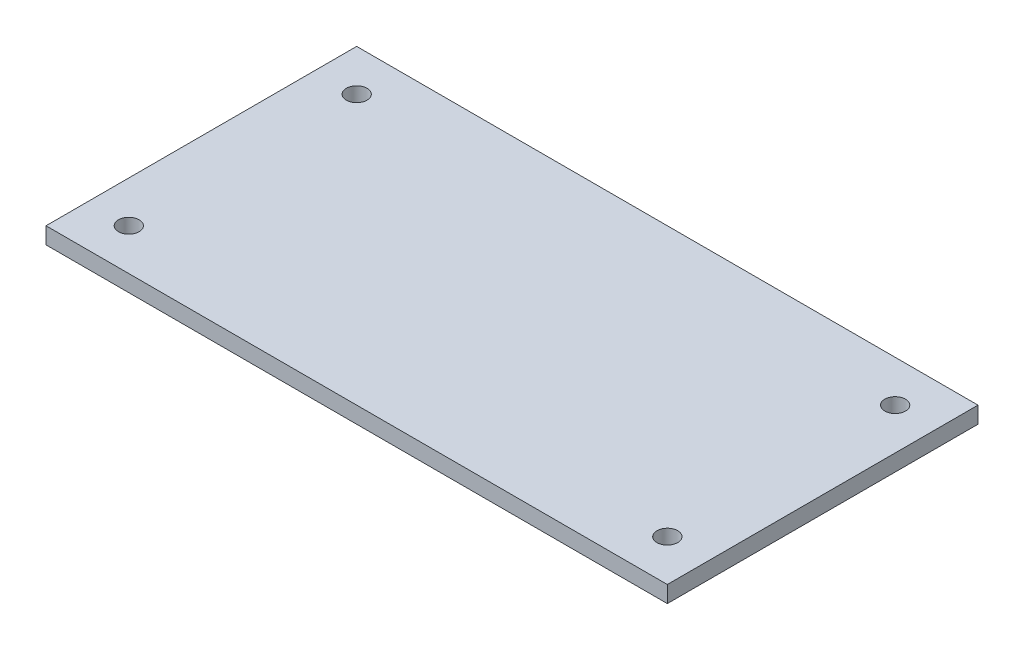
ISO-10303-21;
HEADER;
FILE_DESCRIPTION(('STEP AP214'),'2;1');
FILE_NAME('part.step','',(''),(''),'','','');
FILE_SCHEMA(('AUTOMOTIVE_DESIGN { 1 0 10303 214 1 1 1 1 }'));
ENDSEC;
DATA;
#1=APPLICATION_CONTEXT('core data for automotive mechanical design processes');
#2=APPLICATION_PROTOCOL_DEFINITION('international standard','automotive_design',2000,#1);
#3=PRODUCT_CONTEXT('',#1,'mechanical');
#4=PRODUCT('Part','Part','',(#3));
#5=PRODUCT_RELATED_PRODUCT_CATEGORY('part','',(#4));
#6=PRODUCT_DEFINITION_FORMATION('','',#4);
#7=PRODUCT_DEFINITION_CONTEXT('part definition',#1,'design');
#8=PRODUCT_DEFINITION('design','',#6,#7);
#9=PRODUCT_DEFINITION_SHAPE('','',#8);
#10=(LENGTH_UNIT() NAMED_UNIT(*) SI_UNIT(.MILLI.,.METRE.));
#11=(NAMED_UNIT(*) PLANE_ANGLE_UNIT() SI_UNIT($,.RADIAN.));
#12=(NAMED_UNIT(*) SI_UNIT($,.STERADIAN.) SOLID_ANGLE_UNIT());
#13=UNCERTAINTY_MEASURE_WITH_UNIT(LENGTH_MEASURE(1.E-05),#10,'distance_accuracy_value','');
#14=(GEOMETRIC_REPRESENTATION_CONTEXT(3) GLOBAL_UNCERTAINTY_ASSIGNED_CONTEXT((#13)) GLOBAL_UNIT_ASSIGNED_CONTEXT((#10,
#11,#12)) REPRESENTATION_CONTEXT('',''));
#15=CARTESIAN_POINT('',(0.,0.,0.));
#16=DIRECTION('',(0.,0.,1.));
#17=DIRECTION('',(1.,0.,0.));
#18=AXIS2_PLACEMENT_3D('',#15,#16,#17);
#19=CARTESIAN_POINT('',(0.,4.,0.));
#20=DIRECTION('',(0.,-1.,0.));
#21=DIRECTION('',(0.,0.,-1.));
#22=AXIS2_PLACEMENT_3D('',#19,#20,#21);
#23=PLANE('',#22);
#24=DIRECTION('',(0.,0.,-1.));
#25=VECTOR('',#24,1.);
#26=CARTESIAN_POINT('',(75.,4.,37.5));
#27=LINE('',#26,#25);
#28=CARTESIAN_POINT('',(75.,4.,37.5));
#29=VERTEX_POINT('',#28);
#30=CARTESIAN_POINT('',(75.,4.,-37.5));
#31=VERTEX_POINT('',#30);
#32=EDGE_CURVE('E89',#29,#31,#27,.T.);
#33=ORIENTED_EDGE('',*,*,#32,.T.);
#34=DIRECTION('',(-1.,0.,0.));
#35=VECTOR('',#34,1.);
#36=CARTESIAN_POINT('',(-75.,4.,-37.5));
#37=LINE('',#36,#35);
#38=CARTESIAN_POINT('',(-75.,4.,-37.5));
#39=VERTEX_POINT('',#38);
#40=EDGE_CURVE('E84',#31,#39,#37,.T.);
#41=ORIENTED_EDGE('',*,*,#40,.T.);
#42=DIRECTION('',(0.,0.,1.));
#43=VECTOR('',#42,1.);
#44=CARTESIAN_POINT('',(-75.,4.,37.5));
#45=LINE('',#44,#43);
#46=CARTESIAN_POINT('',(-75.,4.,37.5));
#47=VERTEX_POINT('',#46);
#48=EDGE_CURVE('E87',#39,#47,#45,.T.);
#49=ORIENTED_EDGE('',*,*,#48,.T.);
#50=DIRECTION('',(1.,0.,0.));
#51=VECTOR('',#50,1.);
#52=CARTESIAN_POINT('',(-75.,4.,37.5));
#53=LINE('',#52,#51);
#54=EDGE_CURVE('E54',#47,#29,#53,.T.);
#55=ORIENTED_EDGE('',*,*,#54,.T.);
#56=EDGE_LOOP('',(#33,#41,#49,#55));
#57=FACE_BOUND('',#56,.T.);
#58=CARTESIAN_POINT('',(-65.,4.,27.5));
#59=DIRECTION('',(0.,1.,0.));
#60=DIRECTION('',(0.,0.,1.));
#61=AXIS2_PLACEMENT_3D('',#58,#59,#60);
#62=CIRCLE('',#61,2.49999999999999);
#63=CARTESIAN_POINT('',(-65.,4.,30.));
#64=VERTEX_POINT('',#63);
#65=EDGE_CURVE('E104',#64,#64,#62,.T.);
#66=ORIENTED_EDGE('',*,*,#65,.F.);
#67=EDGE_LOOP('',(#66));
#68=FACE_BOUND('',#67,.T.);
#69=CARTESIAN_POINT('',(-65.,4.,-27.5));
#70=DIRECTION('',(0.,1.,0.));
#71=DIRECTION('',(0.,0.,-1.));
#72=AXIS2_PLACEMENT_3D('',#69,#70,#71);
#73=CIRCLE('',#72,2.49999999999999);
#74=CARTESIAN_POINT('',(-65.,4.,-30.));
#75=VERTEX_POINT('',#74);
#76=EDGE_CURVE('E119',#75,#75,#73,.T.);
#77=ORIENTED_EDGE('',*,*,#76,.F.);
#78=EDGE_LOOP('',(#77));
#79=FACE_BOUND('',#78,.T.);
#80=CARTESIAN_POINT('',(65.,4.,27.5));
#81=DIRECTION('',(0.,1.,0.));
#82=DIRECTION('',(0.,0.,-1.));
#83=AXIS2_PLACEMENT_3D('',#80,#81,#82);
#84=CIRCLE('',#83,2.50000000000001);
#85=CARTESIAN_POINT('',(65.,4.,25.));
#86=VERTEX_POINT('',#85);
#87=EDGE_CURVE('E125',#86,#86,#84,.T.);
#88=ORIENTED_EDGE('',*,*,#87,.F.);
#89=EDGE_LOOP('',(#88));
#90=FACE_BOUND('',#89,.T.);
#91=CARTESIAN_POINT('',(65.,4.,-27.5));
#92=DIRECTION('',(0.,1.,0.));
#93=DIRECTION('',(0.,0.,1.));
#94=AXIS2_PLACEMENT_3D('',#91,#92,#93);
#95=CIRCLE('',#94,2.50000000000001);
#96=CARTESIAN_POINT('',(65.,4.,-25.));
#97=VERTEX_POINT('',#96);
#98=EDGE_CURVE('E131',#97,#97,#95,.T.);
#99=ORIENTED_EDGE('',*,*,#98,.F.);
#100=EDGE_LOOP('',(#99));
#101=FACE_BOUND('',#100,.T.);
#102=ADVANCED_FACE('F37',(#57,#68,#79,#90,#101),#23,.F.);
#103=CARTESIAN_POINT('',(0.,0.,0.));
#104=DIRECTION('',(0.,-1.,0.));
#105=DIRECTION('',(0.,0.,-1.));
#106=AXIS2_PLACEMENT_3D('',#103,#104,#105);
#107=PLANE('',#106);
#108=CARTESIAN_POINT('',(65.,0.,27.5));
#109=DIRECTION('',(0.,1.,0.));
#110=DIRECTION('',(0.,0.,-1.));
#111=AXIS2_PLACEMENT_3D('',#108,#109,#110);
#112=CIRCLE('',#111,2.50000000000001);
#113=CARTESIAN_POINT('',(65.,0.,25.));
#114=VERTEX_POINT('',#113);
#115=EDGE_CURVE('E128',#114,#114,#112,.T.);
#116=ORIENTED_EDGE('',*,*,#115,.T.);
#117=EDGE_LOOP('',(#116));
#118=FACE_BOUND('',#117,.T.);
#119=CARTESIAN_POINT('',(-65.,0.,27.5));
#120=DIRECTION('',(0.,1.,0.));
#121=DIRECTION('',(0.,0.,1.));
#122=AXIS2_PLACEMENT_3D('',#119,#120,#121);
#123=CIRCLE('',#122,2.49999999999999);
#124=CARTESIAN_POINT('',(-65.,0.,30.));
#125=VERTEX_POINT('',#124);
#126=EDGE_CURVE('E116',#125,#125,#123,.T.);
#127=ORIENTED_EDGE('',*,*,#126,.T.);
#128=EDGE_LOOP('',(#127));
#129=FACE_BOUND('',#128,.T.);
#130=DIRECTION('',(0.,0.,-1.));
#131=VECTOR('',#130,1.);
#132=CARTESIAN_POINT('',(75.,0.,37.5));
#133=LINE('',#132,#131);
#134=CARTESIAN_POINT('',(75.,0.,37.5));
#135=VERTEX_POINT('',#134);
#136=CARTESIAN_POINT('',(75.,0.,-37.5));
#137=VERTEX_POINT('',#136);
#138=EDGE_CURVE('E101',#135,#137,#133,.T.);
#139=ORIENTED_EDGE('',*,*,#138,.F.);
#140=DIRECTION('',(1.,0.,0.));
#141=VECTOR('',#140,1.);
#142=CARTESIAN_POINT('',(-75.,0.,37.5));
#143=LINE('',#142,#141);
#144=CARTESIAN_POINT('',(-75.,0.,37.5));
#145=VERTEX_POINT('',#144);
#146=EDGE_CURVE('E77',#145,#135,#143,.T.);
#147=ORIENTED_EDGE('',*,*,#146,.F.);
#148=DIRECTION('',(0.,0.,1.));
#149=VECTOR('',#148,1.);
#150=CARTESIAN_POINT('',(-75.,0.,37.5));
#151=LINE('',#150,#149);
#152=CARTESIAN_POINT('',(-75.,0.,-37.5));
#153=VERTEX_POINT('',#152);
#154=EDGE_CURVE('E71',#153,#145,#151,.T.);
#155=ORIENTED_EDGE('',*,*,#154,.F.);
#156=DIRECTION('',(-1.,0.,0.));
#157=VECTOR('',#156,1.);
#158=CARTESIAN_POINT('',(-75.,0.,-37.5));
#159=LINE('',#158,#157);
#160=EDGE_CURVE('E93',#137,#153,#159,.T.);
#161=ORIENTED_EDGE('',*,*,#160,.F.);
#162=EDGE_LOOP('',(#139,#147,#155,#161));
#163=FACE_BOUND('',#162,.T.);
#164=CARTESIAN_POINT('',(-65.,0.,-27.5));
#165=DIRECTION('',(0.,1.,0.));
#166=DIRECTION('',(0.,0.,-1.));
#167=AXIS2_PLACEMENT_3D('',#164,#165,#166);
#168=CIRCLE('',#167,2.49999999999999);
#169=CARTESIAN_POINT('',(-65.,0.,-30.));
#170=VERTEX_POINT('',#169);
#171=EDGE_CURVE('E122',#170,#170,#168,.T.);
#172=ORIENTED_EDGE('',*,*,#171,.T.);
#173=EDGE_LOOP('',(#172));
#174=FACE_BOUND('',#173,.T.);
#175=CARTESIAN_POINT('',(65.,0.,-27.5));
#176=DIRECTION('',(0.,1.,0.));
#177=DIRECTION('',(0.,0.,1.));
#178=AXIS2_PLACEMENT_3D('',#175,#176,#177);
#179=CIRCLE('',#178,2.50000000000001);
#180=CARTESIAN_POINT('',(65.,0.,-25.));
#181=VERTEX_POINT('',#180);
#182=EDGE_CURVE('E134',#181,#181,#179,.T.);
#183=ORIENTED_EDGE('',*,*,#182,.T.);
#184=EDGE_LOOP('',(#183));
#185=FACE_BOUND('',#184,.T.);
#186=ADVANCED_FACE('F112',(#118,#129,#163,#174,#185),#107,.T.);
#187=CARTESIAN_POINT('',(75.,4.,37.5));
#188=DIRECTION('',(-1.,0.,0.));
#189=DIRECTION('',(0.,0.,1.));
#190=AXIS2_PLACEMENT_3D('',#187,#188,#189);
#191=PLANE('',#190);
#192=ORIENTED_EDGE('',*,*,#138,.T.);
#193=DIRECTION('',(0.,-1.,0.));
#194=VECTOR('',#193,1.);
#195=CARTESIAN_POINT('',(75.,4.,-37.5));
#196=LINE('',#195,#194);
#197=EDGE_CURVE('E11',#31,#137,#196,.T.);
#198=ORIENTED_EDGE('',*,*,#197,.F.);
#199=ORIENTED_EDGE('',*,*,#32,.F.);
#200=DIRECTION('',(0.,-1.,0.));
#201=VECTOR('',#200,1.);
#202=CARTESIAN_POINT('',(75.,4.,37.5));
#203=LINE('',#202,#201);
#204=EDGE_CURVE('E97',#29,#135,#203,.T.);
#205=ORIENTED_EDGE('',*,*,#204,.T.);
#206=EDGE_LOOP('',(#192,#198,#199,#205));
#207=FACE_BOUND('',#206,.T.);
#208=ADVANCED_FACE('F39',(#207),#191,.F.);
#209=CARTESIAN_POINT('',(-75.,4.,-37.5));
#210=DIRECTION('',(0.,0.,1.));
#211=DIRECTION('',(1.,0.,0.));
#212=AXIS2_PLACEMENT_3D('',#209,#210,#211);
#213=PLANE('',#212);
#214=ORIENTED_EDGE('',*,*,#160,.T.);
#215=DIRECTION('',(0.,-1.,0.));
#216=VECTOR('',#215,1.);
#217=CARTESIAN_POINT('',(-75.,4.,-37.5));
#218=LINE('',#217,#216);
#219=EDGE_CURVE('E46',#39,#153,#218,.T.);
#220=ORIENTED_EDGE('',*,*,#219,.F.);
#221=ORIENTED_EDGE('',*,*,#40,.F.);
#222=ORIENTED_EDGE('',*,*,#197,.T.);
#223=EDGE_LOOP('',(#214,#220,#221,#222));
#224=FACE_BOUND('',#223,.T.);
#225=ADVANCED_FACE('F92',(#224),#213,.F.);
#226=CARTESIAN_POINT('',(-75.,4.,37.5));
#227=DIRECTION('',(1.,0.,0.));
#228=DIRECTION('',(0.,0.,-1.));
#229=AXIS2_PLACEMENT_3D('',#226,#227,#228);
#230=PLANE('',#229);
#231=ORIENTED_EDGE('',*,*,#154,.T.);
#232=DIRECTION('',(0.,-1.,0.));
#233=VECTOR('',#232,1.);
#234=CARTESIAN_POINT('',(-75.,4.,37.5));
#235=LINE('',#234,#233);
#236=EDGE_CURVE('E94',#47,#145,#235,.T.);
#237=ORIENTED_EDGE('',*,*,#236,.F.);
#238=ORIENTED_EDGE('',*,*,#48,.F.);
#239=ORIENTED_EDGE('',*,*,#219,.T.);
#240=EDGE_LOOP('',(#231,#237,#238,#239));
#241=FACE_BOUND('',#240,.T.);
#242=ADVANCED_FACE('F95',(#241),#230,.F.);
#243=CARTESIAN_POINT('',(-75.,4.,37.5));
#244=DIRECTION('',(0.,0.,-1.));
#245=DIRECTION('',(-1.,0.,0.));
#246=AXIS2_PLACEMENT_3D('',#243,#244,#245);
#247=PLANE('',#246);
#248=ORIENTED_EDGE('',*,*,#146,.T.);
#249=ORIENTED_EDGE('',*,*,#204,.F.);
#250=ORIENTED_EDGE('',*,*,#54,.F.);
#251=ORIENTED_EDGE('',*,*,#236,.T.);
#252=EDGE_LOOP('',(#248,#249,#250,#251));
#253=FACE_BOUND('',#252,.T.);
#254=ADVANCED_FACE('F109',(#253),#247,.F.);
#255=CARTESIAN_POINT('',(-65.,4.,27.5));
#256=DIRECTION('',(0.,-1.,0.));
#257=DIRECTION('',(0.,0.,-1.));
#258=AXIS2_PLACEMENT_3D('',#255,#256,#257);
#259=CYLINDRICAL_SURFACE('',#258,2.49999999999999);
#260=ORIENTED_EDGE('',*,*,#65,.T.);
#261=EDGE_LOOP('',(#260));
#262=FACE_BOUND('',#261,.T.);
#263=ORIENTED_EDGE('',*,*,#126,.F.);
#264=EDGE_LOOP('',(#263));
#265=FACE_BOUND('',#264,.T.);
#266=ADVANCED_FACE('F151',(#262,#265),#259,.F.);
#267=CARTESIAN_POINT('',(-65.,4.,-27.5));
#268=DIRECTION('',(0.,-1.,0.));
#269=DIRECTION('',(0.,0.,-1.));
#270=AXIS2_PLACEMENT_3D('',#267,#268,#269);
#271=CYLINDRICAL_SURFACE('',#270,2.49999999999999);
#272=ORIENTED_EDGE('',*,*,#76,.T.);
#273=EDGE_LOOP('',(#272));
#274=FACE_BOUND('',#273,.T.);
#275=ORIENTED_EDGE('',*,*,#171,.F.);
#276=EDGE_LOOP('',(#275));
#277=FACE_BOUND('',#276,.T.);
#278=ADVANCED_FACE('F197',(#274,#277),#271,.F.);
#279=CARTESIAN_POINT('',(65.,4.,27.5));
#280=DIRECTION('',(0.,-1.,0.));
#281=DIRECTION('',(0.,0.,-1.));
#282=AXIS2_PLACEMENT_3D('',#279,#280,#281);
#283=CYLINDRICAL_SURFACE('',#282,2.50000000000001);
#284=ORIENTED_EDGE('',*,*,#87,.T.);
#285=EDGE_LOOP('',(#284));
#286=FACE_BOUND('',#285,.T.);
#287=ORIENTED_EDGE('',*,*,#115,.F.);
#288=EDGE_LOOP('',(#287));
#289=FACE_BOUND('',#288,.T.);
#290=ADVANCED_FACE('F205',(#286,#289),#283,.F.);
#291=CARTESIAN_POINT('',(65.,4.,-27.5));
#292=DIRECTION('',(0.,-1.,0.));
#293=DIRECTION('',(0.,0.,-1.));
#294=AXIS2_PLACEMENT_3D('',#291,#292,#293);
#295=CYLINDRICAL_SURFACE('',#294,2.50000000000001);
#296=ORIENTED_EDGE('',*,*,#98,.T.);
#297=EDGE_LOOP('',(#296));
#298=FACE_BOUND('',#297,.T.);
#299=ORIENTED_EDGE('',*,*,#182,.F.);
#300=EDGE_LOOP('',(#299));
#301=FACE_BOUND('',#300,.T.);
#302=ADVANCED_FACE('F140',(#298,#301),#295,.F.);
#303=CLOSED_SHELL('',(#102,#186,#208,#225,#242,#254,#266,#278,#290,#302));
#304=MANIFOLD_SOLID_BREP('B2',#303);
#305=ADVANCED_BREP_SHAPE_REPRESENTATION('',(#18,#304),#14);
#306=SHAPE_DEFINITION_REPRESENTATION(#9,#305);
ENDSEC;
END-ISO-10303-21;
